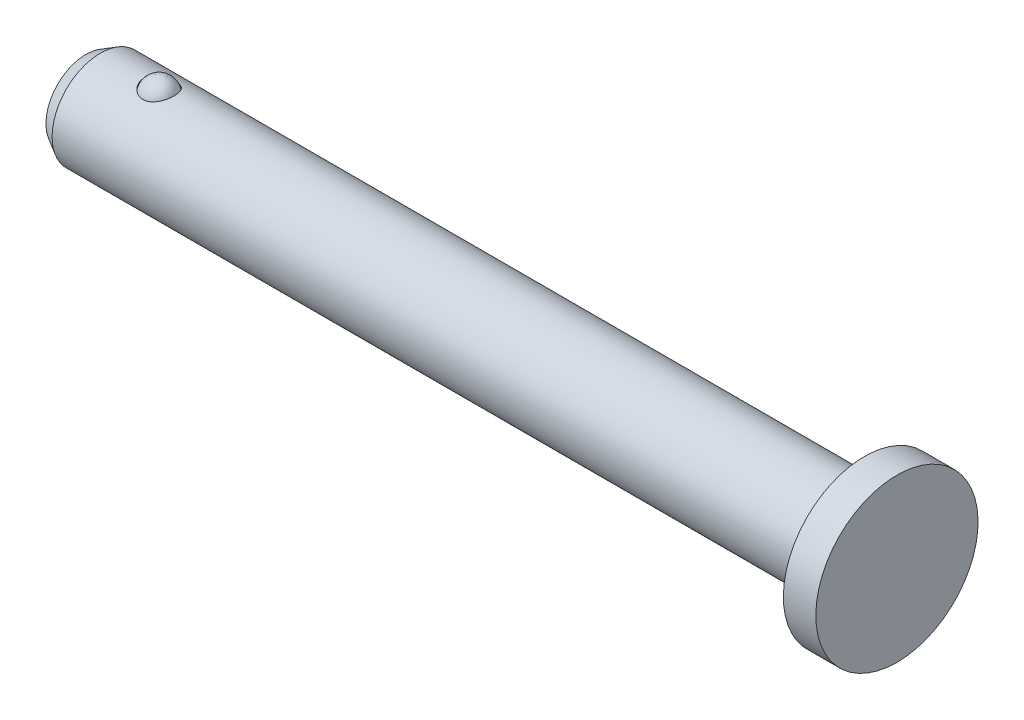
ISO-10303-21;
HEADER;
FILE_DESCRIPTION(('STEP AP214'),'2;1');
FILE_NAME('part.step','',(''),(''),'','','');
FILE_SCHEMA(('AUTOMOTIVE_DESIGN { 1 0 10303 214 1 1 1 1 }'));
ENDSEC;
DATA;
#1=APPLICATION_CONTEXT('core data for automotive mechanical design processes');
#2=APPLICATION_PROTOCOL_DEFINITION('international standard','automotive_design',2000,#1);
#3=PRODUCT_CONTEXT('',#1,'mechanical');
#4=PRODUCT('Part','Part','',(#3));
#5=PRODUCT_RELATED_PRODUCT_CATEGORY('part','',(#4));
#6=PRODUCT_DEFINITION_FORMATION('','',#4);
#7=PRODUCT_DEFINITION_CONTEXT('part definition',#1,'design');
#8=PRODUCT_DEFINITION('design','',#6,#7);
#9=PRODUCT_DEFINITION_SHAPE('','',#8);
#10=(LENGTH_UNIT() NAMED_UNIT(*) SI_UNIT(.MILLI.,.METRE.));
#11=(NAMED_UNIT(*) PLANE_ANGLE_UNIT() SI_UNIT($,.RADIAN.));
#12=(NAMED_UNIT(*) SI_UNIT($,.STERADIAN.) SOLID_ANGLE_UNIT());
#13=UNCERTAINTY_MEASURE_WITH_UNIT(LENGTH_MEASURE(1.E-05),#10,'distance_accuracy_value','');
#14=(GEOMETRIC_REPRESENTATION_CONTEXT(3) GLOBAL_UNCERTAINTY_ASSIGNED_CONTEXT((#13)) GLOBAL_UNIT_ASSIGNED_CONTEXT((#10,
#11,#12)) REPRESENTATION_CONTEXT('',''));
#15=CARTESIAN_POINT('',(0.,0.,0.));
#16=DIRECTION('',(0.,0.,1.));
#17=DIRECTION('',(1.,0.,0.));
#18=AXIS2_PLACEMENT_3D('',#15,#16,#17);
#19=CARTESIAN_POINT('',(-19.84375,0.,0.));
#20=DIRECTION('',(-1.,0.,0.));
#21=DIRECTION('',(0.,-1.,0.));
#22=AXIS2_PLACEMENT_3D('',#19,#20,#21);
#23=CYLINDRICAL_SURFACE('',#22,2.3622);
#24=CARTESIAN_POINT('',(-19.13509,0.,0.));
#25=DIRECTION('',(-1.,0.,0.));
#26=DIRECTION('',(0.,-1.,0.));
#27=AXIS2_PLACEMENT_3D('',#24,#25,#26);
#28=CIRCLE('',#27,2.3622);
#29=CARTESIAN_POINT('',(-19.13509,-2.3622,0.));
#30=VERTEX_POINT('',#29);
#31=EDGE_CURVE('P0_E27',#30,#30,#28,.T.);
#32=ORIENTED_EDGE('',*,*,#31,.F.);
#33=EDGE_LOOP('',(#32));
#34=FACE_BOUND('',#33,.T.);
#35=CARTESIAN_POINT('',(18.25625,0.,0.));
#36=DIRECTION('',(-1.,0.,0.));
#37=DIRECTION('',(0.,-1.,0.));
#38=AXIS2_PLACEMENT_3D('',#35,#36,#37);
#39=CIRCLE('',#38,2.3622);
#40=CARTESIAN_POINT('',(18.25625,-2.3622,0.));
#41=VERTEX_POINT('',#40);
#42=EDGE_CURVE('P0_E10',#41,#41,#39,.T.);
#43=ORIENTED_EDGE('',*,*,#42,.T.);
#44=EDGE_LOOP('',(#43));
#45=FACE_BOUND('',#44,.T.);
#46=CARTESIAN_POINT('',(-16.26235,2.22581604673215,-0.791032089178223));
#47=CARTESIAN_POINT('',(-16.3018338222643,2.22581576398312,-0.791032519638611));
#48=CARTESIAN_POINT('',(-16.3413151384197,2.22697971671572,-0.787780239460785));
#49=CARTESIAN_POINT('',(-16.4190911852111,2.23149491079169,-0.774896744356573));
#50=CARTESIAN_POINT('',(-16.4573858392532,2.2348462930174,-0.765265118565094));
#51=CARTESIAN_POINT('',(-16.531633713184,2.24333848583653,-0.739997800068515));
#52=CARTESIAN_POINT('',(-16.5675913296129,2.24847581373636,-0.724373786774381));
#53=CARTESIAN_POINT('',(-16.6363604141592,2.25998083212616,-0.687636848342259));
#54=CARTESIAN_POINT('',(-16.6691713829048,2.26634871742327,-0.666523053944658));
#55=CARTESIAN_POINT('',(-16.7319315200548,2.27988127975236,-0.618680689218365));
#56=CARTESIAN_POINT('',(-16.7617565640189,2.28706485050395,-0.59179497242801));
#57=CARTESIAN_POINT('',(-16.8167458077474,2.30133787147742,-0.533600878356375));
#58=CARTESIAN_POINT('',(-16.8419088865026,2.30842729868224,-0.502291440535603));
#59=CARTESIAN_POINT('',(-16.88866080437,2.32229610981989,-0.433849997368854));
#60=CARTESIAN_POINT('',(-16.9099016466427,2.32902369976236,-0.396469482014577));
#61=CARTESIAN_POINT('',(-16.9462545129409,2.34094584755715,-0.318610784362629));
#62=CARTESIAN_POINT('',(-16.9613651181152,2.34614005042941,-0.278131887514649));
#63=CARTESIAN_POINT('',(-16.9857004779035,2.3546627054261,-0.193473280151713));
#64=CARTESIAN_POINT('',(-16.9946653937695,2.35790814356074,-0.149210288520307));
#65=CARTESIAN_POINT('',(-17.005565894284,2.36186996349137,-0.0597154884593806));
#66=CARTESIAN_POINT('',(-17.0075008699652,2.36258612618922,-0.0144835964404188));
#67=CARTESIAN_POINT('',(-17.0042909971991,2.36141021290238,0.0762430533264944));
#68=CARTESIAN_POINT('',(-16.9990605263757,2.35948659277288,0.12173440739389));
#69=CARTESIAN_POINT('',(-16.9814508372294,2.35317206611294,0.211137527329617));
#70=CARTESIAN_POINT('',(-16.9690713024393,2.34878105035866,0.255049223179884));
#71=CARTESIAN_POINT('',(-16.9373785333382,2.33799474034002,0.340003755419017));
#72=CARTESIAN_POINT('',(-16.9180697195015,2.33160072420234,0.381048400920872));
#73=CARTESIAN_POINT('',(-16.8728542738949,2.31749884585933,0.459087628468663));
#74=CARTESIAN_POINT('',(-16.8469476298871,2.30979098121703,0.49608220300213));
#75=CARTESIAN_POINT('',(-16.7895191404422,2.2940716483114,0.564297213422603));
#76=CARTESIAN_POINT('',(-16.7580957761656,2.28606718272386,0.59560198834643));
#77=CARTESIAN_POINT('',(-16.6900563583582,2.27059247122217,0.65211919780701));
#78=CARTESIAN_POINT('',(-16.6534418764304,2.26312206464838,0.677333470010341));
#79=CARTESIAN_POINT('',(-16.5779492741709,2.25001785060625,0.719636287127462));
#80=CARTESIAN_POINT('',(-16.5392775456061,2.24431058256401,0.73706966099699));
#81=CARTESIAN_POINT('',(-16.4592512672779,2.23497292980211,0.764920542936363));
#82=CARTESIAN_POINT('',(-16.4178981594483,2.23134143896186,0.775341788088755));
#83=CARTESIAN_POINT('',(-16.336791790642,2.22680429519513,0.788273335332938));
#84=CARTESIAN_POINT('',(-16.2971273529941,2.2257265947787,0.791283526133024));
#85=CARTESIAN_POINT('',(-16.2178529464748,2.2259171339851,0.790747912230159));
#86=CARTESIAN_POINT('',(-16.1782429675224,2.227184856437,0.787203552820129));
#87=CARTESIAN_POINT('',(-16.101593807461,2.23183155461559,0.77392686631853));
#88=CARTESIAN_POINT('',(-16.0645129744794,2.23513795566731,0.764407057193666));
#89=CARTESIAN_POINT('',(-15.9924941222932,2.24343404277332,0.739703383423265));
#90=CARTESIAN_POINT('',(-15.9575563106065,2.24842389153994,0.724518971254892));
#91=CARTESIAN_POINT('',(-15.8896511257475,2.25973866548061,0.688430400089749));
#92=CARTESIAN_POINT('',(-15.8567728995766,2.26609879126542,0.667369988967333));
#93=CARTESIAN_POINT('',(-15.7948539005421,2.27941389290418,0.620368260180015));
#94=CARTESIAN_POINT('',(-15.7658141812176,2.28636903120949,0.594425607222328));
#95=CARTESIAN_POINT('',(-15.7103363875522,2.30067315029258,0.53650441012868));
#96=CARTESIAN_POINT('',(-15.6841940827522,2.30801802589022,0.504241497413384));
#97=CARTESIAN_POINT('',(-15.6373294223548,2.3219066096982,0.435840003810775));
#98=CARTESIAN_POINT('',(-15.6166085654881,2.32845009610334,0.399700355105054));
#99=CARTESIAN_POINT('',(-15.5799154074514,2.34044485511104,0.322365815909071));
#100=CARTESIAN_POINT('',(-15.5642733166028,2.34581462134006,0.281001264451536));
#101=CARTESIAN_POINT('',(-15.5396525932013,2.35443088539652,0.196122971548608));
#102=CARTESIAN_POINT('',(-15.5306749478103,2.35767706866266,0.152608912728051));
#103=CARTESIAN_POINT('',(-15.5193857562819,2.36177692867522,0.0635170638966761));
#104=CARTESIAN_POINT('',(-15.5172440137684,2.36256964717617,0.0179148433694454));
#105=CARTESIAN_POINT('',(-15.520139881845,2.3615088375365,-0.0730313594257117));
#106=CARTESIAN_POINT('',(-15.5251778997728,2.35965515925471,-0.118375326895323));
#107=CARTESIAN_POINT('',(-15.5423917858139,2.35347668943244,-0.207728305434119));
#108=CARTESIAN_POINT('',(-15.5545996260354,2.34914083140647,-0.251730402335729));
#109=CARTESIAN_POINT('',(-15.5859777734291,2.33844323829137,-0.33692140450069));
#110=CARTESIAN_POINT('',(-15.6051483348,2.33208142923882,-0.378110206989596));
#111=CARTESIAN_POINT('',(-15.6499743354645,2.31806542607961,-0.456209651369723));
#112=CARTESIAN_POINT('',(-15.6755888264204,2.31041949036449,-0.493145237461023));
#113=CARTESIAN_POINT('',(-15.7328670809521,2.29467177360045,-0.561885478042451));
#114=CARTESIAN_POINT('',(-15.7645302727704,2.28657003568757,-0.593690616967873));
#115=CARTESIAN_POINT('',(-15.8321103675284,2.27114006586694,-0.65018826947417));
#116=CARTESIAN_POINT('',(-15.8678630627565,2.26379555842983,-0.675072287191636));
#117=CARTESIAN_POINT('',(-15.9434509291089,2.25051576769323,-0.718107031490448));
#118=CARTESIAN_POINT('',(-15.9832838483709,2.24457971300892,-0.736261446834664));
#119=CARTESIAN_POINT('',(-16.0625351985796,2.23529527948482,-0.763964093369265));
#120=CARTESIAN_POINT('',(-16.1017351816544,2.23177879622831,-0.77408143316942));
#121=CARTESIAN_POINT('',(-16.1814079558051,2.22703972798425,-0.787614032349747));
#122=CARTESIAN_POINT('',(-16.221880294314,2.22581633654123,-0.79103164796954));
#123=CARTESIAN_POINT('',(-16.26235,2.22581604673215,-0.791032089178223));
#124=B_SPLINE_CURVE_WITH_KNOTS('',3,(#46,#47,#48,#49,#50,#51,#52,#53,#54,#55,#56,#57,#58,#59,
#60,#61,#62,#63,#64,#65,#66,#67,#68,#69,#70,#71,#72,#73,#74,#75,#76,#77,#78,#79,#80,#81,#82,#83,
#84,#85,#86,#87,#88,#89,#90,#91,#92,#93,#94,#95,#96,#97,#98,#99,#100,#101,#102,#103,#104,#105,
#106,#107,#108,#109,#110,#111,#112,#113,#114,#115,#116,#117,#118,#119,#120,#121,#122,#123),
.UNSPECIFIED.,.T.,.F.,(4,2,2,2,2,2,2,2,2,2,2,2,2,2,2,2,2,2,2,2,2,2,2,2,2,2,2,2,2,2,2,2,2,2,2,2,
2,2,4),(0.,0.118299361509028,0.236606342891336,0.354683901324815,0.472780167721913,
0.594630449676335,0.716509993647939,0.846477480289179,0.976475030932797,1.11167665655919,
1.24688999372124,1.38373321192027,1.52058248821507,1.65734461742627,1.79410700031295,
1.92863866932185,2.06312969570307,2.19085824756083,2.31851867302866,2.43729849240827,
2.55605212369601,2.6708045306772,2.78556803214262,2.90373452362426,3.02193338072498,
3.14788853933123,3.27387848087818,3.40691156896659,3.53996435847092,3.67629744685247,
3.81263827028837,3.94959173936421,4.08655020891101,4.22265943045034,4.35875579253439,
4.49059132495186,4.62235448583304,4.74365036609798,4.86490357990958),.UNSPECIFIED.);
#125=CARTESIAN_POINT('',(-16.26235,2.22581604673215,-0.791032089178223));
#126=VERTEX_POINT('',#125);
#127=EDGE_CURVE('P0_E19',#126,#126,#124,.T.);
#128=ORIENTED_EDGE('',*,*,#127,.F.);
#129=EDGE_LOOP('',(#128));
#130=FACE_BOUND('',#129,.T.);
#131=ADVANCED_FACE('P0_F15',(#34,#45,#130),#23,.T.);
#132=CARTESIAN_POINT('',(18.25625,2.3622,0.));
#133=DIRECTION('',(1.,0.,0.));
#134=DIRECTION('',(0.,1.,0.));
#135=AXIS2_PLACEMENT_3D('',#132,#133,#134);
#136=PLANE('',#135);
#137=ORIENTED_EDGE('',*,*,#42,.F.);
#138=EDGE_LOOP('',(#137));
#139=FACE_BOUND('',#138,.T.);
#140=CARTESIAN_POINT('',(18.25625,0.,0.));
#141=DIRECTION('',(-1.,0.,0.));
#142=DIRECTION('',(0.,-1.,0.));
#143=AXIS2_PLACEMENT_3D('',#140,#141,#142);
#144=CIRCLE('',#143,3.96875);
#145=CARTESIAN_POINT('',(18.25625,-3.96875,0.));
#146=VERTEX_POINT('',#145);
#147=EDGE_CURVE('P0_E39',#146,#146,#144,.T.);
#148=ORIENTED_EDGE('',*,*,#147,.T.);
#149=EDGE_LOOP('',(#148));
#150=FACE_BOUND('',#149,.T.);
#151=ADVANCED_FACE('P0_F17',(#139,#150),#136,.F.);
#152=CARTESIAN_POINT('',(-19.13509,0.,0.));
#153=DIRECTION('',(1.,0.,0.));
#154=DIRECTION('',(0.,1.,0.));
#155=AXIS2_PLACEMENT_3D('',#152,#153,#154);
#156=CONICAL_SURFACE('',#155,2.3622,0.523598775598299);
#157=CARTESIAN_POINT('',(-19.84375,0.,0.));
#158=DIRECTION('',(-1.,0.,0.));
#159=DIRECTION('',(0.,-1.,0.));
#160=AXIS2_PLACEMENT_3D('',#157,#158,#159);
#161=CIRCLE('',#160,1.95305495823608);
#162=CARTESIAN_POINT('',(-19.84375,-1.95305495823608,0.));
#163=VERTEX_POINT('',#162);
#164=EDGE_CURVE('P0_E31',#163,#163,#161,.T.);
#165=ORIENTED_EDGE('',*,*,#164,.F.);
#166=EDGE_LOOP('',(#165));
#167=FACE_BOUND('',#166,.T.);
#168=ORIENTED_EDGE('',*,*,#31,.T.);
#169=EDGE_LOOP('',(#168));
#170=FACE_BOUND('',#169,.T.);
#171=ADVANCED_FACE('P0_F54',(#167,#170),#156,.T.);
#172=CARTESIAN_POINT('',(-19.84375,1.95305495823608,0.));
#173=DIRECTION('',(1.,0.,0.));
#174=DIRECTION('',(0.,1.,0.));
#175=AXIS2_PLACEMENT_3D('',#172,#173,#174);
#176=PLANE('',#175);
#177=ORIENTED_EDGE('',*,*,#164,.T.);
#178=EDGE_LOOP('',(#177));
#179=FACE_BOUND('',#178,.T.);
#180=ADVANCED_FACE('P0_F61',(#179),#176,.F.);
#181=CARTESIAN_POINT('',(19.84375,3.96875,0.));
#182=DIRECTION('',(-1.,0.,0.));
#183=DIRECTION('',(0.,-1.,0.));
#184=AXIS2_PLACEMENT_3D('',#181,#182,#183);
#185=PLANE('',#184);
#186=CARTESIAN_POINT('',(19.84375,0.,0.));
#187=DIRECTION('',(-1.,0.,0.));
#188=DIRECTION('',(0.,-1.,0.));
#189=AXIS2_PLACEMENT_3D('',#186,#187,#188);
#190=CIRCLE('',#189,3.96875);
#191=CARTESIAN_POINT('',(19.84375,-3.96875,0.));
#192=VERTEX_POINT('',#191);
#193=EDGE_CURVE('P0_E36',#192,#192,#190,.T.);
#194=ORIENTED_EDGE('',*,*,#193,.F.);
#195=EDGE_LOOP('',(#194));
#196=FACE_BOUND('',#195,.T.);
#197=ADVANCED_FACE('P0_F65',(#196),#185,.F.);
#198=CARTESIAN_POINT('',(-19.84375,0.,0.));
#199=DIRECTION('',(-1.,0.,0.));
#200=DIRECTION('',(0.,-1.,0.));
#201=AXIS2_PLACEMENT_3D('',#198,#199,#200);
#202=CYLINDRICAL_SURFACE('',#201,3.96875);
#203=ORIENTED_EDGE('',*,*,#147,.F.);
#204=EDGE_LOOP('',(#203));
#205=FACE_BOUND('',#204,.T.);
#206=ORIENTED_EDGE('',*,*,#193,.T.);
#207=EDGE_LOOP('',(#206));
#208=FACE_BOUND('',#207,.T.);
#209=ADVANCED_FACE('P0_F69',(#205,#208),#202,.T.);
#210=CARTESIAN_POINT('',(-16.26235,2.02985730626251,0.));
#211=DIRECTION('',(-1.,0.,0.));
#212=DIRECTION('',(0.,1.,0.));
#213=AXIS2_PLACEMENT_3D('',#210,#211,#212);
#214=SPHERICAL_SURFACE('',#213,0.814942693737488);
#215=ORIENTED_EDGE('',*,*,#127,.T.);
#216=EDGE_LOOP('',(#215));
#217=FACE_BOUND('',#216,.T.);
#218=ADVANCED_FACE('P0_F46',(#217),#214,.F.);
#219=CLOSED_SHELL('',(#131,#151,#171,#180,#197,#209,#218));
#220=MANIFOLD_SOLID_BREP('P0_B1',#219);
#221=CARTESIAN_POINT('',(-16.26235,2.02985730626251,0.));
#222=DIRECTION('',(-1.,0.,0.));
#223=DIRECTION('',(0.,1.,0.));
#224=AXIS2_PLACEMENT_3D('',#221,#222,#223);
#225=SPHERICAL_SURFACE('',#224,0.789542693737488);
#226=CARTESIAN_POINT('',(-17.0518926937375,2.02985730626251,0.));
#227=VERTEX_POINT('',#226);
#228=VERTEX_LOOP('',#227);
#229=FACE_BOUND('',#228,.T.);
#230=ADVANCED_FACE('P1_F12',(#229),#225,.T.);
#231=CLOSED_SHELL('',(#230));
#232=MANIFOLD_SOLID_BREP('P1_B1',#231);
#233=ADVANCED_BREP_SHAPE_REPRESENTATION('',(#18,#220,#232),#14);
#234=SHAPE_DEFINITION_REPRESENTATION(#9,#233);
ENDSEC;
END-ISO-10303-21;
